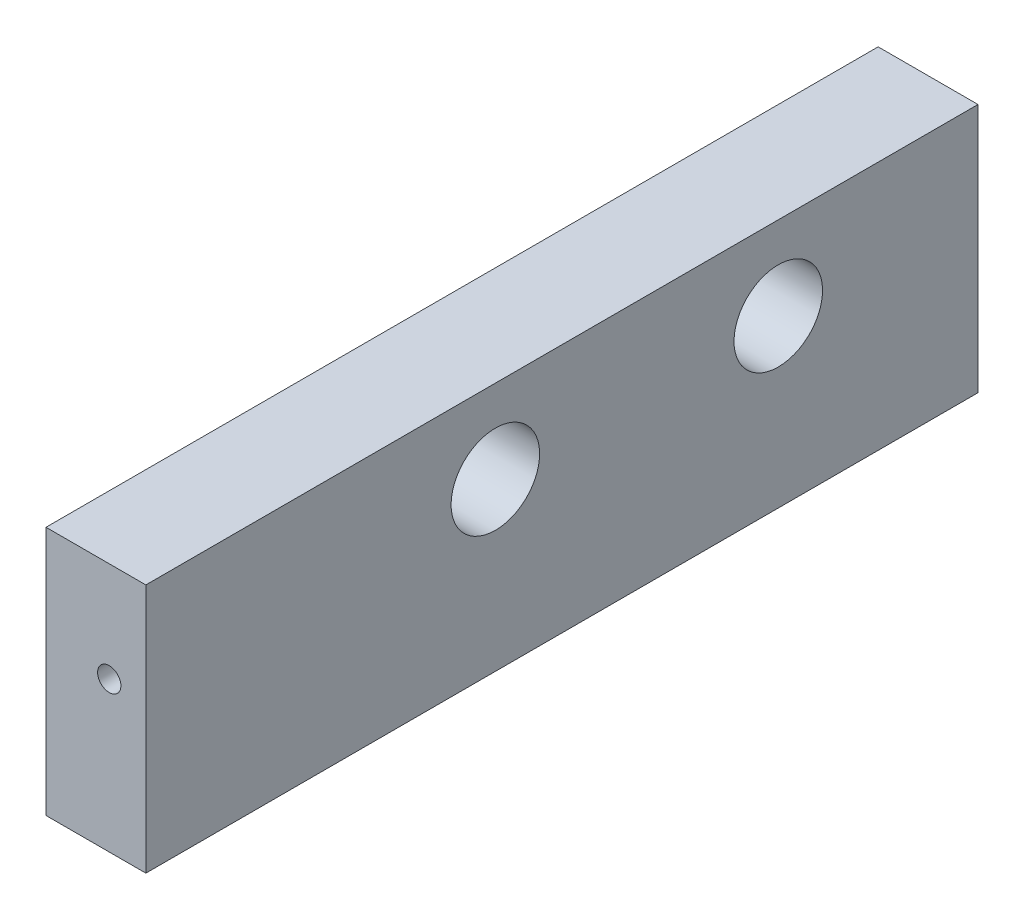
ISO-10303-21;
HEADER;
FILE_DESCRIPTION(('STEP AP214'),'2;1');
FILE_NAME('part.step','',(''),(''),'','','');
FILE_SCHEMA(('AUTOMOTIVE_DESIGN { 1 0 10303 214 1 1 1 1 }'));
ENDSEC;
DATA;
#1=APPLICATION_CONTEXT('core data for automotive mechanical design processes');
#2=APPLICATION_PROTOCOL_DEFINITION('international standard','automotive_design',2000,#1);
#3=PRODUCT_CONTEXT('',#1,'mechanical');
#4=PRODUCT('Part','Part','',(#3));
#5=PRODUCT_RELATED_PRODUCT_CATEGORY('part','',(#4));
#6=PRODUCT_DEFINITION_FORMATION('','',#4);
#7=PRODUCT_DEFINITION_CONTEXT('part definition',#1,'design');
#8=PRODUCT_DEFINITION('design','',#6,#7);
#9=PRODUCT_DEFINITION_SHAPE('','',#8);
#10=(LENGTH_UNIT() NAMED_UNIT(*) SI_UNIT(.MILLI.,.METRE.));
#11=(NAMED_UNIT(*) PLANE_ANGLE_UNIT() SI_UNIT($,.RADIAN.));
#12=(NAMED_UNIT(*) SI_UNIT($,.STERADIAN.) SOLID_ANGLE_UNIT());
#13=UNCERTAINTY_MEASURE_WITH_UNIT(LENGTH_MEASURE(1.E-05),#10,'distance_accuracy_value','');
#14=(GEOMETRIC_REPRESENTATION_CONTEXT(3) GLOBAL_UNCERTAINTY_ASSIGNED_CONTEXT((#13)) GLOBAL_UNIT_ASSIGNED_CONTEXT((#10,
#11,#12)) REPRESENTATION_CONTEXT('',''));
#15=CARTESIAN_POINT('',(0.,0.,0.));
#16=DIRECTION('',(0.,0.,1.));
#17=DIRECTION('',(1.,0.,0.));
#18=AXIS2_PLACEMENT_3D('',#15,#16,#17);
#19=CARTESIAN_POINT('',(0.,0.,-63.5));
#20=DIRECTION('',(-1.,0.,0.));
#21=DIRECTION('',(0.,-1.,0.));
#22=AXIS2_PLACEMENT_3D('',#19,#20,#21);
#23=PLANE('',#22);
#24=CARTESIAN_POINT('',(0.,12.7,-26.67));
#25=DIRECTION('',(-1.,0.,0.));
#26=DIRECTION('',(0.,-1.,0.));
#27=AXIS2_PLACEMENT_3D('',#24,#25,#26);
#28=CIRCLE('',#27,3.3782);
#29=CARTESIAN_POINT('',(0.,9.3218,-26.67));
#30=VERTEX_POINT('',#29);
#31=EDGE_CURVE('E163',#30,#30,#28,.T.);
#32=ORIENTED_EDGE('',*,*,#31,.F.);
#33=EDGE_LOOP('',(#32));
#34=FACE_BOUND('',#33,.T.);
#35=CARTESIAN_POINT('',(0.,12.7,-48.26));
#36=DIRECTION('',(-1.,0.,0.));
#37=DIRECTION('',(0.,-1.,0.));
#38=AXIS2_PLACEMENT_3D('',#35,#36,#37);
#39=CIRCLE('',#38,3.3782);
#40=CARTESIAN_POINT('',(0.,9.3218,-48.26));
#41=VERTEX_POINT('',#40);
#42=EDGE_CURVE('E165',#41,#41,#39,.T.);
#43=ORIENTED_EDGE('',*,*,#42,.F.);
#44=EDGE_LOOP('',(#43));
#45=FACE_BOUND('',#44,.T.);
#46=DIRECTION('',(0.,-1.,0.));
#47=VECTOR('',#46,1.);
#48=CARTESIAN_POINT('',(0.,0.,0.));
#49=LINE('',#48,#47);
#50=CARTESIAN_POINT('',(0.,19.05,0.));
#51=VERTEX_POINT('',#50);
#52=CARTESIAN_POINT('',(0.,0.,0.));
#53=VERTEX_POINT('',#52);
#54=EDGE_CURVE('E108',#51,#53,#49,.T.);
#55=ORIENTED_EDGE('',*,*,#54,.F.);
#56=DIRECTION('',(0.,0.,1.));
#57=VECTOR('',#56,1.);
#58=CARTESIAN_POINT('',(0.,19.05,-63.5));
#59=LINE('',#58,#57);
#60=CARTESIAN_POINT('',(0.,19.05,-63.5));
#61=VERTEX_POINT('',#60);
#62=EDGE_CURVE('E11',#61,#51,#59,.T.);
#63=ORIENTED_EDGE('',*,*,#62,.F.);
#64=DIRECTION('',(0.,-1.,0.));
#65=VECTOR('',#64,1.);
#66=CARTESIAN_POINT('',(0.,0.,-63.5));
#67=LINE('',#66,#65);
#68=CARTESIAN_POINT('',(0.,0.,-63.5));
#69=VERTEX_POINT('',#68);
#70=EDGE_CURVE('E101',#61,#69,#67,.T.);
#71=ORIENTED_EDGE('',*,*,#70,.T.);
#72=DIRECTION('',(0.,0.,1.));
#73=VECTOR('',#72,1.);
#74=CARTESIAN_POINT('',(0.,0.,-63.5));
#75=LINE('',#74,#73);
#76=EDGE_CURVE('E46',#69,#53,#75,.T.);
#77=ORIENTED_EDGE('',*,*,#76,.T.);
#78=EDGE_LOOP('',(#55,#63,#71,#77));
#79=FACE_BOUND('',#78,.T.);
#80=ADVANCED_FACE('F43',(#34,#45,#79),#23,.T.);
#81=CARTESIAN_POINT('',(0.,19.05,-63.5));
#82=DIRECTION('',(0.,1.,0.));
#83=DIRECTION('',(0.,0.,1.));
#84=AXIS2_PLACEMENT_3D('',#81,#82,#83);
#85=PLANE('',#84);
#86=DIRECTION('',(-1.,0.,0.));
#87=VECTOR('',#86,1.);
#88=CARTESIAN_POINT('',(0.,19.05,0.));
#89=LINE('',#88,#87);
#90=CARTESIAN_POINT('',(7.61999999999999,19.05,0.));
#91=VERTEX_POINT('',#90);
#92=EDGE_CURVE('E103',#91,#51,#89,.T.);
#93=ORIENTED_EDGE('',*,*,#92,.F.);
#94=DIRECTION('',(0.,0.,1.));
#95=VECTOR('',#94,1.);
#96=CARTESIAN_POINT('',(7.61999999999999,19.05,-63.5));
#97=LINE('',#96,#95);
#98=CARTESIAN_POINT('',(7.61999999999999,19.05,-63.5));
#99=VERTEX_POINT('',#98);
#100=EDGE_CURVE('E52',#99,#91,#97,.T.);
#101=ORIENTED_EDGE('',*,*,#100,.F.);
#102=DIRECTION('',(-1.,0.,0.));
#103=VECTOR('',#102,1.);
#104=CARTESIAN_POINT('',(0.,19.05,-63.5));
#105=LINE('',#104,#103);
#106=EDGE_CURVE('E98',#99,#61,#105,.T.);
#107=ORIENTED_EDGE('',*,*,#106,.T.);
#108=ORIENTED_EDGE('',*,*,#62,.T.);
#109=EDGE_LOOP('',(#93,#101,#107,#108));
#110=FACE_BOUND('',#109,.T.);
#111=ADVANCED_FACE('F119',(#110),#85,.T.);
#112=CARTESIAN_POINT('',(7.62,0.,-63.5));
#113=DIRECTION('',(1.,0.,0.));
#114=DIRECTION('',(0.,1.,0.));
#115=AXIS2_PLACEMENT_3D('',#112,#113,#114);
#116=PLANE('',#115);
#117=CARTESIAN_POINT('',(7.62,12.7,-26.67));
#118=DIRECTION('',(-1.,0.,0.));
#119=DIRECTION('',(0.,-1.,0.));
#120=AXIS2_PLACEMENT_3D('',#117,#118,#119);
#121=CIRCLE('',#120,3.3782);
#122=CARTESIAN_POINT('',(7.62,9.3218,-26.67));
#123=VERTEX_POINT('',#122);
#124=EDGE_CURVE('E160',#123,#123,#121,.T.);
#125=ORIENTED_EDGE('',*,*,#124,.T.);
#126=EDGE_LOOP('',(#125));
#127=FACE_BOUND('',#126,.T.);
#128=CARTESIAN_POINT('',(7.62,12.7,-48.26));
#129=DIRECTION('',(-1.,0.,0.));
#130=DIRECTION('',(0.,-1.,0.));
#131=AXIS2_PLACEMENT_3D('',#128,#129,#130);
#132=CIRCLE('',#131,3.3782);
#133=CARTESIAN_POINT('',(7.62,9.3218,-48.26));
#134=VERTEX_POINT('',#133);
#135=EDGE_CURVE('E168',#134,#134,#132,.T.);
#136=ORIENTED_EDGE('',*,*,#135,.T.);
#137=EDGE_LOOP('',(#136));
#138=FACE_BOUND('',#137,.T.);
#139=DIRECTION('',(0.,1.,0.));
#140=VECTOR('',#139,1.);
#141=CARTESIAN_POINT('',(7.62,0.,0.));
#142=LINE('',#141,#140);
#143=CARTESIAN_POINT('',(7.62,0.,0.));
#144=VERTEX_POINT('',#143);
#145=EDGE_CURVE('E93',#144,#91,#142,.T.);
#146=ORIENTED_EDGE('',*,*,#145,.F.);
#147=DIRECTION('',(0.,0.,1.));
#148=VECTOR('',#147,1.);
#149=CARTESIAN_POINT('',(7.62,0.,-63.5));
#150=LINE('',#149,#148);
#151=CARTESIAN_POINT('',(7.62,0.,-63.5));
#152=VERTEX_POINT('',#151);
#153=EDGE_CURVE('E88',#152,#144,#150,.T.);
#154=ORIENTED_EDGE('',*,*,#153,.F.);
#155=DIRECTION('',(0.,1.,0.));
#156=VECTOR('',#155,1.);
#157=CARTESIAN_POINT('',(7.62,0.,-63.5));
#158=LINE('',#157,#156);
#159=EDGE_CURVE('E91',#152,#99,#158,.T.);
#160=ORIENTED_EDGE('',*,*,#159,.T.);
#161=ORIENTED_EDGE('',*,*,#100,.T.);
#162=EDGE_LOOP('',(#146,#154,#160,#161));
#163=FACE_BOUND('',#162,.T.);
#164=ADVANCED_FACE('F90',(#127,#138,#163),#116,.T.);
#165=CARTESIAN_POINT('',(0.,0.,-63.5));
#166=DIRECTION('',(0.,-1.,0.));
#167=DIRECTION('',(0.,0.,-1.));
#168=AXIS2_PLACEMENT_3D('',#165,#166,#167);
#169=PLANE('',#168);
#170=DIRECTION('',(1.,0.,0.));
#171=VECTOR('',#170,1.);
#172=CARTESIAN_POINT('',(0.,0.,0.));
#173=LINE('',#172,#171);
#174=EDGE_CURVE('E111',#53,#144,#173,.T.);
#175=ORIENTED_EDGE('',*,*,#174,.F.);
#176=ORIENTED_EDGE('',*,*,#76,.F.);
#177=DIRECTION('',(1.,0.,0.));
#178=VECTOR('',#177,1.);
#179=CARTESIAN_POINT('',(0.,0.,-63.5));
#180=LINE('',#179,#178);
#181=EDGE_CURVE('E97',#69,#152,#180,.T.);
#182=ORIENTED_EDGE('',*,*,#181,.T.);
#183=ORIENTED_EDGE('',*,*,#153,.T.);
#184=EDGE_LOOP('',(#175,#176,#182,#183));
#185=FACE_BOUND('',#184,.T.);
#186=ADVANCED_FACE('F100',(#185),#169,.T.);
#187=CARTESIAN_POINT('',(0.,0.,-63.5));
#188=DIRECTION('',(0.,0.,-1.));
#189=DIRECTION('',(-1.,0.,0.));
#190=AXIS2_PLACEMENT_3D('',#187,#188,#189);
#191=PLANE('',#190);
#192=ORIENTED_EDGE('',*,*,#70,.F.);
#193=ORIENTED_EDGE('',*,*,#106,.F.);
#194=ORIENTED_EDGE('',*,*,#159,.F.);
#195=ORIENTED_EDGE('',*,*,#181,.F.);
#196=EDGE_LOOP('',(#192,#193,#194,#195));
#197=FACE_BOUND('',#196,.T.);
#198=ADVANCED_FACE('F96',(#197),#191,.T.);
#199=CARTESIAN_POINT('',(0.,0.,0.));
#200=DIRECTION('',(0.,0.,-1.));
#201=DIRECTION('',(-1.,0.,0.));
#202=AXIS2_PLACEMENT_3D('',#199,#200,#201);
#203=PLANE('',#202);
#204=CARTESIAN_POINT('',(4.826,11.43,0.));
#205=DIRECTION('',(0.,0.,1.));
#206=DIRECTION('',(1.,0.,0.));
#207=AXIS2_PLACEMENT_3D('',#204,#205,#206);
#208=CIRCLE('',#207,0.889);
#209=CARTESIAN_POINT('',(5.715,11.43,0.));
#210=VERTEX_POINT('',#209);
#211=EDGE_CURVE('E171',#210,#210,#208,.T.);
#212=ORIENTED_EDGE('',*,*,#211,.F.);
#213=EDGE_LOOP('',(#212));
#214=FACE_BOUND('',#213,.T.);
#215=ORIENTED_EDGE('',*,*,#54,.T.);
#216=ORIENTED_EDGE('',*,*,#174,.T.);
#217=ORIENTED_EDGE('',*,*,#145,.T.);
#218=ORIENTED_EDGE('',*,*,#92,.T.);
#219=EDGE_LOOP('',(#215,#216,#217,#218));
#220=FACE_BOUND('',#219,.T.);
#221=ADVANCED_FACE('F118',(#214,#220),#203,.F.);
#222=CARTESIAN_POINT('',(4.826,11.43,-6.35));
#223=DIRECTION('',(0.,0.,1.));
#224=DIRECTION('',(1.,0.,0.));
#225=AXIS2_PLACEMENT_3D('',#222,#223,#224);
#226=CYLINDRICAL_SURFACE('',#225,0.889);
#227=CARTESIAN_POINT('',(4.826,11.43,-6.35));
#228=DIRECTION('',(0.,0.,1.));
#229=DIRECTION('',(1.,0.,0.));
#230=AXIS2_PLACEMENT_3D('',#227,#228,#229);
#231=CIRCLE('',#230,0.889);
#232=CARTESIAN_POINT('',(5.715,11.43,-6.35));
#233=VERTEX_POINT('',#232);
#234=EDGE_CURVE('E112',#233,#233,#231,.T.);
#235=ORIENTED_EDGE('',*,*,#234,.F.);
#236=EDGE_LOOP('',(#235));
#237=FACE_BOUND('',#236,.T.);
#238=ORIENTED_EDGE('',*,*,#211,.T.);
#239=EDGE_LOOP('',(#238));
#240=FACE_BOUND('',#239,.T.);
#241=ADVANCED_FACE('F138',(#237,#240),#226,.F.);
#242=CARTESIAN_POINT('',(4.826,11.43,-6.35));
#243=DIRECTION('',(0.,0.,1.));
#244=DIRECTION('',(1.,0.,0.));
#245=AXIS2_PLACEMENT_3D('',#242,#243,#244);
#246=PLANE('',#245);
#247=ORIENTED_EDGE('',*,*,#234,.T.);
#248=EDGE_LOOP('',(#247));
#249=FACE_BOUND('',#248,.T.);
#250=ADVANCED_FACE('F143',(#249),#246,.T.);
#251=CARTESIAN_POINT('',(7.62,12.7,-48.26));
#252=DIRECTION('',(-1.,0.,0.));
#253=DIRECTION('',(0.,-1.,0.));
#254=AXIS2_PLACEMENT_3D('',#251,#252,#253);
#255=CYLINDRICAL_SURFACE('',#254,3.3782);
#256=ORIENTED_EDGE('',*,*,#135,.F.);
#257=EDGE_LOOP('',(#256));
#258=FACE_BOUND('',#257,.T.);
#259=ORIENTED_EDGE('',*,*,#42,.T.);
#260=EDGE_LOOP('',(#259));
#261=FACE_BOUND('',#260,.T.);
#262=ADVANCED_FACE('F147',(#258,#261),#255,.F.);
#263=CARTESIAN_POINT('',(7.62,12.7,-26.67));
#264=DIRECTION('',(-1.,0.,0.));
#265=DIRECTION('',(0.,-1.,0.));
#266=AXIS2_PLACEMENT_3D('',#263,#264,#265);
#267=CYLINDRICAL_SURFACE('',#266,3.3782);
#268=ORIENTED_EDGE('',*,*,#124,.F.);
#269=EDGE_LOOP('',(#268));
#270=FACE_BOUND('',#269,.T.);
#271=ORIENTED_EDGE('',*,*,#31,.T.);
#272=EDGE_LOOP('',(#271));
#273=FACE_BOUND('',#272,.T.);
#274=ADVANCED_FACE('F151',(#270,#273),#267,.F.);
#275=CLOSED_SHELL('',(#80,#111,#164,#186,#198,#221,#241,#250,#262,#274));
#276=MANIFOLD_SOLID_BREP('B2',#275);
#277=ADVANCED_BREP_SHAPE_REPRESENTATION('',(#18,#276),#14);
#278=SHAPE_DEFINITION_REPRESENTATION(#9,#277);
ENDSEC;
END-ISO-10303-21;
